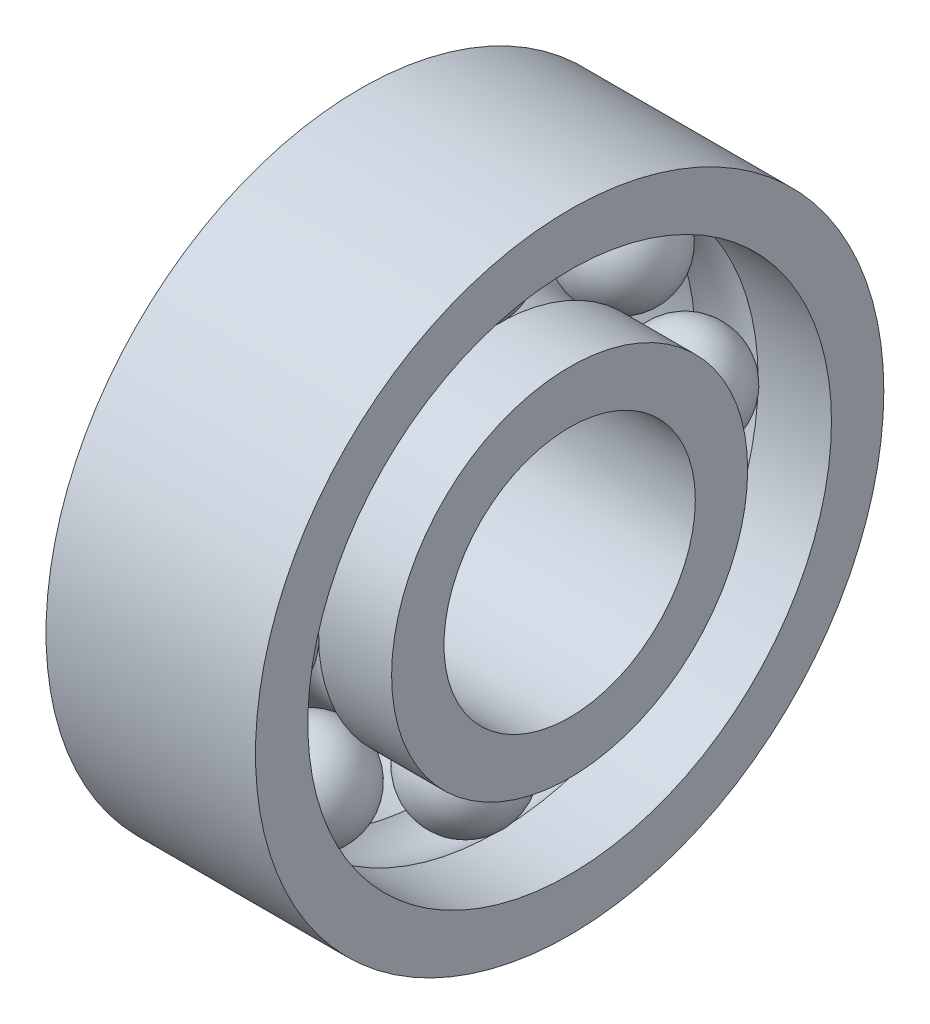
ISO-10303-21;
HEADER;
FILE_DESCRIPTION(('STEP AP214'),'2;1');
FILE_NAME('part.step','',(''),(''),'','','');
FILE_SCHEMA(('AUTOMOTIVE_DESIGN { 1 0 10303 214 1 1 1 1 }'));
ENDSEC;
DATA;
#1=APPLICATION_CONTEXT('core data for automotive mechanical design processes');
#2=APPLICATION_PROTOCOL_DEFINITION('international standard','automotive_design',2000,#1);
#3=PRODUCT_CONTEXT('',#1,'mechanical');
#4=PRODUCT('Part','Part','',(#3));
#5=PRODUCT_RELATED_PRODUCT_CATEGORY('part','',(#4));
#6=PRODUCT_DEFINITION_FORMATION('','',#4);
#7=PRODUCT_DEFINITION_CONTEXT('part definition',#1,'design');
#8=PRODUCT_DEFINITION('design','',#6,#7);
#9=PRODUCT_DEFINITION_SHAPE('','',#8);
#10=(LENGTH_UNIT() NAMED_UNIT(*) SI_UNIT(.MILLI.,.METRE.));
#11=(NAMED_UNIT(*) PLANE_ANGLE_UNIT() SI_UNIT($,.RADIAN.));
#12=(NAMED_UNIT(*) SI_UNIT($,.STERADIAN.) SOLID_ANGLE_UNIT());
#13=UNCERTAINTY_MEASURE_WITH_UNIT(LENGTH_MEASURE(1.E-05),#10,'distance_accuracy_value','');
#14=(GEOMETRIC_REPRESENTATION_CONTEXT(3) GLOBAL_UNCERTAINTY_ASSIGNED_CONTEXT((#13)) GLOBAL_UNIT_ASSIGNED_CONTEXT((#10,
#11,#12)) REPRESENTATION_CONTEXT('',''));
#15=CARTESIAN_POINT('',(0.,0.,0.));
#16=DIRECTION('',(0.,0.,1.));
#17=DIRECTION('',(1.,0.,0.));
#18=AXIS2_PLACEMENT_3D('',#15,#16,#17);
#19=CARTESIAN_POINT('',(2.5,3.71231060122942,-3.71231060122933));
#20=DIRECTION('',(0.,0.707106781186556,-0.707106781186539));
#21=DIRECTION('',(-1.,0.,0.));
#22=AXIS2_PLACEMENT_3D('',#19,#20,#21);
#23=SPHERICAL_SURFACE('',#22,1.25);
#24=CARTESIAN_POINT('',(2.5,4.59619407771262,-4.5961940777125));
#25=VERTEX_POINT('',#24);
#26=VERTEX_LOOP('',#25);
#27=FACE_BOUND('',#26,.T.);
#28=ADVANCED_FACE('F50',(#27),#23,.T.);
#29=CLOSED_SHELL('',(#28));
#30=MANIFOLD_SOLID_BREP('B2',#29);
#31=CARTESIAN_POINT('',(2.5,0.,-5.25));
#32=DIRECTION('',(0.,0.,-1.));
#33=DIRECTION('',(-1.,0.,0.));
#34=AXIS2_PLACEMENT_3D('',#31,#32,#33);
#35=SPHERICAL_SURFACE('',#34,1.25);
#36=CARTESIAN_POINT('',(2.5,0.,-6.5));
#37=VERTEX_POINT('',#36);
#38=VERTEX_LOOP('',#37);
#39=FACE_BOUND('',#38,.T.);
#40=ADVANCED_FACE('F71',(#39),#35,.T.);
#41=CLOSED_SHELL('',(#40));
#42=MANIFOLD_SOLID_BREP('B6',#41);
#43=CARTESIAN_POINT('',(2.5,-3.71231060122934,-3.71231060122941));
#44=DIRECTION('',(0.,-0.707106781186541,-0.707106781186554));
#45=DIRECTION('',(-1.,0.,0.));
#46=AXIS2_PLACEMENT_3D('',#43,#44,#45);
#47=SPHERICAL_SURFACE('',#46,1.25);
#48=CARTESIAN_POINT('',(2.5,-4.59619407771252,-4.5961940777126));
#49=VERTEX_POINT('',#48);
#50=VERTEX_LOOP('',#49);
#51=FACE_BOUND('',#50,.T.);
#52=ADVANCED_FACE('F92',(#51),#47,.T.);
#53=CLOSED_SHELL('',(#52));
#54=MANIFOLD_SOLID_BREP('B46',#53);
#55=CARTESIAN_POINT('',(2.5,-5.25,0.));
#56=DIRECTION('',(0.,-1.,0.));
#57=DIRECTION('',(-1.,0.,0.));
#58=AXIS2_PLACEMENT_3D('',#55,#56,#57);
#59=SPHERICAL_SURFACE('',#58,1.25);
#60=CARTESIAN_POINT('',(2.5,-6.5,0.));
#61=VERTEX_POINT('',#60);
#62=VERTEX_LOOP('',#61);
#63=FACE_BOUND('',#62,.T.);
#64=ADVANCED_FACE('F113',(#63),#59,.T.);
#65=CLOSED_SHELL('',(#64));
#66=MANIFOLD_SOLID_BREP('B67',#65);
#67=CARTESIAN_POINT('',(2.5,-3.71231060122939,3.71231060122936));
#68=DIRECTION('',(0.,-0.707106781186551,0.707106781186544));
#69=DIRECTION('',(-1.,0.,0.));
#70=AXIS2_PLACEMENT_3D('',#67,#68,#69);
#71=SPHERICAL_SURFACE('',#70,1.25);
#72=CARTESIAN_POINT('',(2.5,-4.59619407771258,4.59619407771254));
#73=VERTEX_POINT('',#72);
#74=VERTEX_LOOP('',#73);
#75=FACE_BOUND('',#74,.T.);
#76=ADVANCED_FACE('F134',(#75),#71,.T.);
#77=CLOSED_SHELL('',(#76));
#78=MANIFOLD_SOLID_BREP('B88',#77);
#79=CARTESIAN_POINT('',(2.5,0.,5.25));
#80=DIRECTION('',(0.,0.,1.));
#81=DIRECTION('',(-1.,0.,0.));
#82=AXIS2_PLACEMENT_3D('',#79,#80,#81);
#83=SPHERICAL_SURFACE('',#82,1.25);
#84=CARTESIAN_POINT('',(2.5,0.,6.5));
#85=VERTEX_POINT('',#84);
#86=VERTEX_LOOP('',#85);
#87=FACE_BOUND('',#86,.T.);
#88=ADVANCED_FACE('F155',(#87),#83,.T.);
#89=CLOSED_SHELL('',(#88));
#90=MANIFOLD_SOLID_BREP('B109',#89);
#91=CARTESIAN_POINT('',(2.5,3.71231060122937,3.71231060122938));
#92=DIRECTION('',(0.,0.707106781186546,0.707106781186549));
#93=DIRECTION('',(-1.,0.,0.));
#94=AXIS2_PLACEMENT_3D('',#91,#92,#93);
#95=SPHERICAL_SURFACE('',#94,1.25);
#96=CARTESIAN_POINT('',(2.5,4.59619407771255,4.59619407771257));
#97=VERTEX_POINT('',#96);
#98=VERTEX_LOOP('',#97);
#99=FACE_BOUND('',#98,.T.);
#100=ADVANCED_FACE('F176',(#99),#95,.T.);
#101=CLOSED_SHELL('',(#100));
#102=MANIFOLD_SOLID_BREP('B130',#101);
#103=CARTESIAN_POINT('',(2.5,5.25,0.));
#104=DIRECTION('',(0.,1.,0.));
#105=DIRECTION('',(-1.,0.,0.));
#106=AXIS2_PLACEMENT_3D('',#103,#104,#105);
#107=SPHERICAL_SURFACE('',#106,1.25);
#108=CARTESIAN_POINT('',(2.5,6.5,0.));
#109=VERTEX_POINT('',#108);
#110=VERTEX_LOOP('',#109);
#111=FACE_BOUND('',#110,.T.);
#112=ADVANCED_FACE('F199',(#111),#107,.T.);
#113=CLOSED_SHELL('',(#112));
#114=MANIFOLD_SOLID_BREP('B151',#113);
#115=CARTESIAN_POINT('',(2.5,0.,0.));
#116=DIRECTION('',(1.,0.,0.));
#117=DIRECTION('',(0.,0.,-1.));
#118=AXIS2_PLACEMENT_3D('',#115,#116,#117);
#119=TOROIDAL_SURFACE('',#118,5.25,1.25);
#120=CARTESIAN_POINT('',(3.25,0.,0.));
#121=DIRECTION('',(1.,0.,0.));
#122=DIRECTION('',(0.,0.,-1.));
#123=AXIS2_PLACEMENT_3D('',#120,#121,#122);
#124=CIRCLE('',#123,4.25);
#125=CARTESIAN_POINT('',(3.25,0.,-4.25));
#126=VERTEX_POINT('',#125);
#127=EDGE_CURVE('E243',#126,#126,#124,.T.);
#128=ORIENTED_EDGE('',*,*,#127,.F.);
#129=EDGE_LOOP('',(#128));
#130=FACE_BOUND('',#129,.T.);
#131=CARTESIAN_POINT('',(1.75,0.,0.));
#132=DIRECTION('',(1.,0.,0.));
#133=DIRECTION('',(0.,0.,-1.));
#134=AXIS2_PLACEMENT_3D('',#131,#132,#133);
#135=CIRCLE('',#134,4.25);
#136=CARTESIAN_POINT('',(1.75,0.,-4.25));
#137=VERTEX_POINT('',#136);
#138=EDGE_CURVE('E198',#137,#137,#135,.T.);
#139=ORIENTED_EDGE('',*,*,#138,.T.);
#140=EDGE_LOOP('',(#139));
#141=FACE_BOUND('',#140,.T.);
#142=ADVANCED_FACE('F221',(#130,#141),#119,.F.);
#143=CARTESIAN_POINT('',(88.99,0.,0.));
#144=DIRECTION('',(1.,0.,0.));
#145=DIRECTION('',(0.,0.,-1.));
#146=AXIS2_PLACEMENT_3D('',#143,#144,#145);
#147=CYLINDRICAL_SURFACE('',#146,4.25);
#148=ORIENTED_EDGE('',*,*,#138,.F.);
#149=EDGE_LOOP('',(#148));
#150=FACE_BOUND('',#149,.T.);
#151=CARTESIAN_POINT('',(0.,0.,0.));
#152=DIRECTION('',(1.,0.,0.));
#153=DIRECTION('',(0.,0.,-1.));
#154=AXIS2_PLACEMENT_3D('',#151,#152,#153);
#155=CIRCLE('',#154,4.25);
#156=CARTESIAN_POINT('',(0.,0.,-4.25));
#157=VERTEX_POINT('',#156);
#158=EDGE_CURVE('E227',#157,#157,#155,.T.);
#159=ORIENTED_EDGE('',*,*,#158,.T.);
#160=EDGE_LOOP('',(#159));
#161=FACE_BOUND('',#160,.T.);
#162=ADVANCED_FACE('F250',(#150,#161),#147,.T.);
#163=CARTESIAN_POINT('',(0.,0.,0.));
#164=DIRECTION('',(-1.,0.,0.));
#165=DIRECTION('',(0.,0.,1.));
#166=AXIS2_PLACEMENT_3D('',#163,#164,#165);
#167=PLANE('',#166);
#168=CARTESIAN_POINT('',(0.,0.,0.));
#169=DIRECTION('',(1.,0.,0.));
#170=DIRECTION('',(0.,0.,-1.));
#171=AXIS2_PLACEMENT_3D('',#168,#169,#170);
#172=CIRCLE('',#171,3.);
#173=CARTESIAN_POINT('',(0.,0.,-3.));
#174=VERTEX_POINT('',#173);
#175=EDGE_CURVE('E231',#174,#174,#172,.T.);
#176=ORIENTED_EDGE('',*,*,#175,.T.);
#177=EDGE_LOOP('',(#176));
#178=FACE_BOUND('',#177,.T.);
#179=ORIENTED_EDGE('',*,*,#158,.F.);
#180=EDGE_LOOP('',(#179));
#181=FACE_BOUND('',#180,.T.);
#182=ADVANCED_FACE('F254',(#178,#181),#167,.T.);
#183=CARTESIAN_POINT('',(88.99,0.,0.));
#184=DIRECTION('',(1.,0.,0.));
#185=DIRECTION('',(0.,0.,-1.));
#186=AXIS2_PLACEMENT_3D('',#183,#184,#185);
#187=CYLINDRICAL_SURFACE('',#186,3.);
#188=CARTESIAN_POINT('',(5.,0.,0.));
#189=DIRECTION('',(1.,0.,0.));
#190=DIRECTION('',(0.,0.,-1.));
#191=AXIS2_PLACEMENT_3D('',#188,#189,#190);
#192=CIRCLE('',#191,3.);
#193=CARTESIAN_POINT('',(5.,0.,-3.));
#194=VERTEX_POINT('',#193);
#195=EDGE_CURVE('E235',#194,#194,#192,.T.);
#196=ORIENTED_EDGE('',*,*,#195,.T.);
#197=EDGE_LOOP('',(#196));
#198=FACE_BOUND('',#197,.T.);
#199=ORIENTED_EDGE('',*,*,#175,.F.);
#200=EDGE_LOOP('',(#199));
#201=FACE_BOUND('',#200,.T.);
#202=ADVANCED_FACE('F259',(#198,#201),#187,.F.);
#203=CARTESIAN_POINT('',(5.,0.,0.));
#204=DIRECTION('',(-1.,0.,0.));
#205=DIRECTION('',(0.,0.,1.));
#206=AXIS2_PLACEMENT_3D('',#203,#204,#205);
#207=PLANE('',#206);
#208=ORIENTED_EDGE('',*,*,#195,.F.);
#209=EDGE_LOOP('',(#208));
#210=FACE_BOUND('',#209,.T.);
#211=CARTESIAN_POINT('',(5.,0.,0.));
#212=DIRECTION('',(1.,0.,0.));
#213=DIRECTION('',(0.,0.,-1.));
#214=AXIS2_PLACEMENT_3D('',#211,#212,#213);
#215=CIRCLE('',#214,4.25);
#216=CARTESIAN_POINT('',(5.,0.,-4.25));
#217=VERTEX_POINT('',#216);
#218=EDGE_CURVE('E240',#217,#217,#215,.T.);
#219=ORIENTED_EDGE('',*,*,#218,.T.);
#220=EDGE_LOOP('',(#219));
#221=FACE_BOUND('',#220,.T.);
#222=ADVANCED_FACE('F265',(#210,#221),#207,.F.);
#223=CARTESIAN_POINT('',(88.99,0.,0.));
#224=DIRECTION('',(1.,0.,0.));
#225=DIRECTION('',(0.,0.,-1.));
#226=AXIS2_PLACEMENT_3D('',#223,#224,#225);
#227=CYLINDRICAL_SURFACE('',#226,4.25);
#228=ORIENTED_EDGE('',*,*,#218,.F.);
#229=EDGE_LOOP('',(#228));
#230=FACE_BOUND('',#229,.T.);
#231=ORIENTED_EDGE('',*,*,#127,.T.);
#232=EDGE_LOOP('',(#231));
#233=FACE_BOUND('',#232,.T.);
#234=ADVANCED_FACE('F247',(#230,#233),#227,.T.);
#235=CLOSED_SHELL('',(#142,#162,#182,#202,#222,#234));
#236=MANIFOLD_SOLID_BREP('B172',#235);
#237=CARTESIAN_POINT('',(2.5,0.,0.));
#238=DIRECTION('',(1.,0.,0.));
#239=DIRECTION('',(0.,0.,-1.));
#240=AXIS2_PLACEMENT_3D('',#237,#238,#239);
#241=TOROIDAL_SURFACE('',#240,5.25,1.25);
#242=CARTESIAN_POINT('',(1.75,0.,0.));
#243=DIRECTION('',(1.,0.,0.));
#244=DIRECTION('',(0.,0.,-1.));
#245=AXIS2_PLACEMENT_3D('',#242,#243,#244);
#246=CIRCLE('',#245,6.25);
#247=CARTESIAN_POINT('',(1.75,0.,-6.25));
#248=VERTEX_POINT('',#247);
#249=EDGE_CURVE('E352',#248,#248,#246,.T.);
#250=ORIENTED_EDGE('',*,*,#249,.F.);
#251=EDGE_LOOP('',(#250));
#252=FACE_BOUND('',#251,.T.);
#253=CARTESIAN_POINT('',(3.25,0.,0.));
#254=DIRECTION('',(1.,0.,0.));
#255=DIRECTION('',(0.,0.,-1.));
#256=AXIS2_PLACEMENT_3D('',#253,#254,#255);
#257=CIRCLE('',#256,6.25);
#258=CARTESIAN_POINT('',(3.25,0.,-6.25));
#259=VERTEX_POINT('',#258);
#260=EDGE_CURVE('E220',#259,#259,#257,.T.);
#261=ORIENTED_EDGE('',*,*,#260,.T.);
#262=EDGE_LOOP('',(#261));
#263=FACE_BOUND('',#262,.T.);
#264=ADVANCED_FACE('F325',(#252,#263),#241,.F.);
#265=CARTESIAN_POINT('',(88.99,0.,0.));
#266=DIRECTION('',(1.,0.,0.));
#267=DIRECTION('',(0.,0.,-1.));
#268=AXIS2_PLACEMENT_3D('',#265,#266,#267);
#269=CYLINDRICAL_SURFACE('',#268,6.25);
#270=CARTESIAN_POINT('',(5.,0.,0.));
#271=DIRECTION('',(1.,0.,0.));
#272=DIRECTION('',(0.,0.,-1.));
#273=AXIS2_PLACEMENT_3D('',#270,#271,#272);
#274=CIRCLE('',#273,6.25);
#275=CARTESIAN_POINT('',(5.,0.,-6.25));
#276=VERTEX_POINT('',#275);
#277=EDGE_CURVE('E332',#276,#276,#274,.T.);
#278=ORIENTED_EDGE('',*,*,#277,.T.);
#279=EDGE_LOOP('',(#278));
#280=FACE_BOUND('',#279,.T.);
#281=ORIENTED_EDGE('',*,*,#260,.F.);
#282=EDGE_LOOP('',(#281));
#283=FACE_BOUND('',#282,.T.);
#284=ADVANCED_FACE('F361',(#280,#283),#269,.F.);
#285=CARTESIAN_POINT('',(5.,0.,0.));
#286=DIRECTION('',(-1.,0.,0.));
#287=DIRECTION('',(0.,0.,1.));
#288=AXIS2_PLACEMENT_3D('',#285,#286,#287);
#289=PLANE('',#288);
#290=ORIENTED_EDGE('',*,*,#277,.F.);
#291=EDGE_LOOP('',(#290));
#292=FACE_BOUND('',#291,.T.);
#293=CARTESIAN_POINT('',(5.,0.,0.));
#294=DIRECTION('',(1.,0.,0.));
#295=DIRECTION('',(0.,0.,-1.));
#296=AXIS2_PLACEMENT_3D('',#293,#294,#295);
#297=CIRCLE('',#296,7.5);
#298=CARTESIAN_POINT('',(5.,0.,-7.5));
#299=VERTEX_POINT('',#298);
#300=EDGE_CURVE('E337',#299,#299,#297,.T.);
#301=ORIENTED_EDGE('',*,*,#300,.T.);
#302=EDGE_LOOP('',(#301));
#303=FACE_BOUND('',#302,.T.);
#304=ADVANCED_FACE('F365',(#292,#303),#289,.F.);
#305=CARTESIAN_POINT('',(88.99,0.,0.));
#306=DIRECTION('',(1.,0.,0.));
#307=DIRECTION('',(0.,0.,-1.));
#308=AXIS2_PLACEMENT_3D('',#305,#306,#307);
#309=CYLINDRICAL_SURFACE('',#308,7.5);
#310=ORIENTED_EDGE('',*,*,#300,.F.);
#311=EDGE_LOOP('',(#310));
#312=FACE_BOUND('',#311,.T.);
#313=CARTESIAN_POINT('',(0.,0.,0.));
#314=DIRECTION('',(1.,0.,0.));
#315=DIRECTION('',(0.,0.,-1.));
#316=AXIS2_PLACEMENT_3D('',#313,#314,#315);
#317=CIRCLE('',#316,7.5);
#318=CARTESIAN_POINT('',(0.,0.,-7.5));
#319=VERTEX_POINT('',#318);
#320=EDGE_CURVE('E342',#319,#319,#317,.T.);
#321=ORIENTED_EDGE('',*,*,#320,.T.);
#322=EDGE_LOOP('',(#321));
#323=FACE_BOUND('',#322,.T.);
#324=ADVANCED_FACE('F369',(#312,#323),#309,.T.);
#325=CARTESIAN_POINT('',(0.,0.,0.));
#326=DIRECTION('',(-1.,0.,0.));
#327=DIRECTION('',(0.,0.,1.));
#328=AXIS2_PLACEMENT_3D('',#325,#326,#327);
#329=PLANE('',#328);
#330=CARTESIAN_POINT('',(0.,0.,0.));
#331=DIRECTION('',(1.,0.,0.));
#332=DIRECTION('',(0.,0.,-1.));
#333=AXIS2_PLACEMENT_3D('',#330,#331,#332);
#334=CIRCLE('',#333,6.25);
#335=CARTESIAN_POINT('',(0.,0.,-6.25));
#336=VERTEX_POINT('',#335);
#337=EDGE_CURVE('E348',#336,#336,#334,.T.);
#338=ORIENTED_EDGE('',*,*,#337,.T.);
#339=EDGE_LOOP('',(#338));
#340=FACE_BOUND('',#339,.T.);
#341=ORIENTED_EDGE('',*,*,#320,.F.);
#342=EDGE_LOOP('',(#341));
#343=FACE_BOUND('',#342,.T.);
#344=ADVANCED_FACE('F376',(#340,#343),#329,.T.);
#345=CARTESIAN_POINT('',(88.99,0.,0.));
#346=DIRECTION('',(1.,0.,0.));
#347=DIRECTION('',(0.,0.,-1.));
#348=AXIS2_PLACEMENT_3D('',#345,#346,#347);
#349=CYLINDRICAL_SURFACE('',#348,6.25);
#350=ORIENTED_EDGE('',*,*,#249,.T.);
#351=EDGE_LOOP('',(#350));
#352=FACE_BOUND('',#351,.T.);
#353=ORIENTED_EDGE('',*,*,#337,.F.);
#354=EDGE_LOOP('',(#353));
#355=FACE_BOUND('',#354,.T.);
#356=ADVANCED_FACE('F357',(#352,#355),#349,.F.);
#357=CLOSED_SHELL('',(#264,#284,#304,#324,#344,#356));
#358=MANIFOLD_SOLID_BREP('B193',#357);
#359=ADVANCED_BREP_SHAPE_REPRESENTATION('',(#18,#30,#42,#54,#66,#78,#90,#102,#114,#236,#358),#14);
#360=SHAPE_DEFINITION_REPRESENTATION(#9,#359);
ENDSEC;
END-ISO-10303-21;
